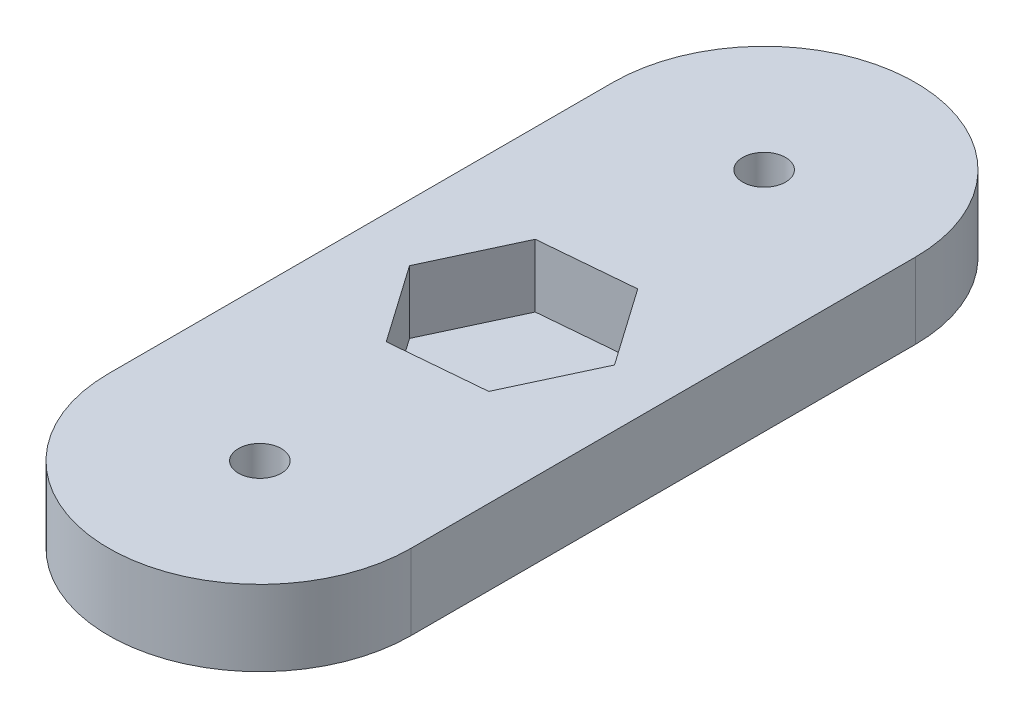
ISO-10303-21;
HEADER;
FILE_DESCRIPTION(('STEP AP214'),'2;1');
FILE_NAME('part.step','',(''),(''),'','','');
FILE_SCHEMA(('AUTOMOTIVE_DESIGN { 1 0 10303 214 1 1 1 1 }'));
ENDSEC;
DATA;
#1=APPLICATION_CONTEXT('core data for automotive mechanical design processes');
#2=APPLICATION_PROTOCOL_DEFINITION('international standard','automotive_design',2000,#1);
#3=PRODUCT_CONTEXT('',#1,'mechanical');
#4=PRODUCT('Part','Part','',(#3));
#5=PRODUCT_RELATED_PRODUCT_CATEGORY('part','',(#4));
#6=PRODUCT_DEFINITION_FORMATION('','',#4);
#7=PRODUCT_DEFINITION_CONTEXT('part definition',#1,'design');
#8=PRODUCT_DEFINITION('design','',#6,#7);
#9=PRODUCT_DEFINITION_SHAPE('','',#8);
#10=(LENGTH_UNIT() NAMED_UNIT(*) SI_UNIT(.MILLI.,.METRE.));
#11=(NAMED_UNIT(*) PLANE_ANGLE_UNIT() SI_UNIT($,.RADIAN.));
#12=(NAMED_UNIT(*) SI_UNIT($,.STERADIAN.) SOLID_ANGLE_UNIT());
#13=UNCERTAINTY_MEASURE_WITH_UNIT(LENGTH_MEASURE(1.E-05),#10,'distance_accuracy_value','');
#14=(GEOMETRIC_REPRESENTATION_CONTEXT(3) GLOBAL_UNCERTAINTY_ASSIGNED_CONTEXT((#13)) GLOBAL_UNIT_ASSIGNED_CONTEXT((#10,
#11,#12)) REPRESENTATION_CONTEXT('',''));
#15=CARTESIAN_POINT('',(0.,0.,0.));
#16=DIRECTION('',(0.,0.,1.));
#17=DIRECTION('',(1.,0.,0.));
#18=AXIS2_PLACEMENT_3D('',#15,#16,#17);
#19=CARTESIAN_POINT('',(0.,6.,0.));
#20=DIRECTION('',(0.,1.,0.));
#21=DIRECTION('',(0.,0.,1.));
#22=AXIS2_PLACEMENT_3D('',#19,#20,#21);
#23=PLANE('',#22);
#24=DIRECTION('',(0.996194698091745,0.,-0.0871557427476616));
#25=VECTOR('',#24,1.);
#26=CARTESIAN_POINT('',(-3.17198397334575,6.,-13.1976584174146));
#27=LINE('',#26,#25);
#28=CARTESIAN_POINT('',(-3.17198397334575,6.,-13.1976584174146));
#29=VERTEX_POINT('',#28);
#30=CARTESIAN_POINT('',(4.30500862906536,6.,-13.8518105073928));
#31=VERTEX_POINT('',#30);
#32=EDGE_CURVE('E48',#29,#31,#27,.T.);
#33=ORIENTED_EDGE('',*,*,#32,.F.);
#34=DIRECTION('',(0.573576436351049,0.,0.81915204428899));
#35=VECTOR('',#34,1.);
#36=CARTESIAN_POINT('',(-7.47699260241111,6.,-19.3458479100218));
#37=LINE('',#36,#35);
#38=CARTESIAN_POINT('',(-7.47699260241111,6.,-19.3458479100218));
#39=VERTEX_POINT('',#38);
#40=EDGE_CURVE('E140',#39,#29,#37,.T.);
#41=ORIENTED_EDGE('',*,*,#40,.F.);
#42=DIRECTION('',(-0.422618261740697,0.,0.906307787036651));
#43=VECTOR('',#42,1.);
#44=CARTESIAN_POINT('',(-4.30500862906535,6.,-26.1481894926072));
#45=LINE('',#44,#43);
#46=CARTESIAN_POINT('',(-4.30500862906535,6.,-26.1481894926072));
#47=VERTEX_POINT('',#46);
#48=EDGE_CURVE('E143',#47,#39,#45,.T.);
#49=ORIENTED_EDGE('',*,*,#48,.F.);
#50=DIRECTION('',(-0.996194698091745,0.,0.0871557427476619));
#51=VECTOR('',#50,1.);
#52=CARTESIAN_POINT('',(3.17198397334575,6.,-26.8023415825854));
#53=LINE('',#52,#51);
#54=CARTESIAN_POINT('',(3.17198397334575,6.,-26.8023415825854));
#55=VERTEX_POINT('',#54);
#56=EDGE_CURVE('E159',#55,#47,#53,.T.);
#57=ORIENTED_EDGE('',*,*,#56,.F.);
#58=DIRECTION('',(-0.573576436351049,0.,-0.819152044288989));
#59=VECTOR('',#58,1.);
#60=CARTESIAN_POINT('',(7.47699260241111,6.,-20.6541520899782));
#61=LINE('',#60,#59);
#62=CARTESIAN_POINT('',(7.47699260241111,6.,-20.6541520899782));
#63=VERTEX_POINT('',#62);
#64=EDGE_CURVE('E156',#63,#55,#61,.T.);
#65=ORIENTED_EDGE('',*,*,#64,.F.);
#66=DIRECTION('',(0.422618261740696,0.,-0.906307787036651));
#67=VECTOR('',#66,1.);
#68=CARTESIAN_POINT('',(4.30500862906536,6.,-13.8518105073928));
#69=LINE('',#68,#67);
#70=EDGE_CURVE('E154',#31,#63,#69,.T.);
#71=ORIENTED_EDGE('',*,*,#70,.F.);
#72=EDGE_LOOP('',(#33,#41,#49,#57,#65,#71));
#73=FACE_BOUND('',#72,.T.);
#74=CARTESIAN_POINT('',(0.,6.,-40.));
#75=DIRECTION('',(0.,1.,0.));
#76=DIRECTION('',(0.,0.,1.));
#77=AXIS2_PLACEMENT_3D('',#74,#75,#76);
#78=CIRCLE('',#77,1.7);
#79=CARTESIAN_POINT('',(0.,6.,-38.3));
#80=VERTEX_POINT('',#79);
#81=EDGE_CURVE('E180',#80,#80,#78,.T.);
#82=ORIENTED_EDGE('',*,*,#81,.F.);
#83=EDGE_LOOP('',(#82));
#84=FACE_BOUND('',#83,.T.);
#85=CARTESIAN_POINT('',(0.,6.,0.));
#86=DIRECTION('',(0.,1.,0.));
#87=DIRECTION('',(0.,0.,1.));
#88=AXIS2_PLACEMENT_3D('',#85,#86,#87);
#89=CIRCLE('',#88,12.);
#90=CARTESIAN_POINT('',(-12.,6.,0.));
#91=VERTEX_POINT('',#90);
#92=CARTESIAN_POINT('',(12.,6.,0.));
#93=VERTEX_POINT('',#92);
#94=EDGE_CURVE('E186',#91,#93,#89,.T.);
#95=ORIENTED_EDGE('',*,*,#94,.T.);
#96=DIRECTION('',(0.,0.,-1.));
#97=VECTOR('',#96,1.);
#98=CARTESIAN_POINT('',(12.,6.,0.));
#99=LINE('',#98,#97);
#100=CARTESIAN_POINT('',(12.,6.,-40.));
#101=VERTEX_POINT('',#100);
#102=EDGE_CURVE('E85',#93,#101,#99,.T.);
#103=ORIENTED_EDGE('',*,*,#102,.T.);
#104=CARTESIAN_POINT('',(0.,6.,-40.));
#105=DIRECTION('',(0.,1.,0.));
#106=DIRECTION('',(0.,0.,1.));
#107=AXIS2_PLACEMENT_3D('',#104,#105,#106);
#108=CIRCLE('',#107,12.);
#109=CARTESIAN_POINT('',(-12.,6.,-40.));
#110=VERTEX_POINT('',#109);
#111=EDGE_CURVE('E189',#101,#110,#108,.T.);
#112=ORIENTED_EDGE('',*,*,#111,.T.);
#113=DIRECTION('',(0.,0.,1.));
#114=VECTOR('',#113,1.);
#115=CARTESIAN_POINT('',(-12.,6.,0.));
#116=LINE('',#115,#114);
#117=EDGE_CURVE('E57',#110,#91,#116,.T.);
#118=ORIENTED_EDGE('',*,*,#117,.T.);
#119=EDGE_LOOP('',(#95,#103,#112,#118));
#120=FACE_BOUND('',#119,.T.);
#121=CARTESIAN_POINT('',(0.,6.,0.));
#122=DIRECTION('',(0.,1.,0.));
#123=DIRECTION('',(0.,0.,1.));
#124=AXIS2_PLACEMENT_3D('',#121,#122,#123);
#125=CIRCLE('',#124,1.7);
#126=CARTESIAN_POINT('',(0.,6.,1.7));
#127=VERTEX_POINT('',#126);
#128=EDGE_CURVE('E174',#127,#127,#125,.T.);
#129=ORIENTED_EDGE('',*,*,#128,.F.);
#130=EDGE_LOOP('',(#129));
#131=FACE_BOUND('',#130,.T.);
#132=ADVANCED_FACE('F33',(#73,#84,#120,#131),#23,.T.);
#133=CARTESIAN_POINT('',(0.,0.,0.));
#134=DIRECTION('',(0.,1.,0.));
#135=DIRECTION('',(0.,0.,1.));
#136=AXIS2_PLACEMENT_3D('',#133,#134,#135);
#137=PLANE('',#136);
#138=CARTESIAN_POINT('',(0.,0.,-40.));
#139=DIRECTION('',(0.,1.,0.));
#140=DIRECTION('',(0.,0.,1.));
#141=AXIS2_PLACEMENT_3D('',#138,#139,#140);
#142=CIRCLE('',#141,1.7);
#143=CARTESIAN_POINT('',(0.,0.,-38.3));
#144=VERTEX_POINT('',#143);
#145=EDGE_CURVE('E177',#144,#144,#142,.T.);
#146=ORIENTED_EDGE('',*,*,#145,.T.);
#147=EDGE_LOOP('',(#146));
#148=FACE_BOUND('',#147,.T.);
#149=CARTESIAN_POINT('',(0.,0.,0.));
#150=DIRECTION('',(0.,1.,0.));
#151=DIRECTION('',(0.,0.,1.));
#152=AXIS2_PLACEMENT_3D('',#149,#150,#151);
#153=CIRCLE('',#152,12.);
#154=CARTESIAN_POINT('',(-12.,0.,0.));
#155=VERTEX_POINT('',#154);
#156=CARTESIAN_POINT('',(12.,0.,0.));
#157=VERTEX_POINT('',#156);
#158=EDGE_CURVE('E183',#155,#157,#153,.T.);
#159=ORIENTED_EDGE('',*,*,#158,.F.);
#160=DIRECTION('',(0.,0.,1.));
#161=VECTOR('',#160,1.);
#162=CARTESIAN_POINT('',(-12.,0.,0.));
#163=LINE('',#162,#161);
#164=CARTESIAN_POINT('',(-12.,0.,-40.));
#165=VERTEX_POINT('',#164);
#166=EDGE_CURVE('E78',#165,#155,#163,.T.);
#167=ORIENTED_EDGE('',*,*,#166,.F.);
#168=CARTESIAN_POINT('',(0.,0.,-40.));
#169=DIRECTION('',(0.,1.,0.));
#170=DIRECTION('',(0.,0.,1.));
#171=AXIS2_PLACEMENT_3D('',#168,#169,#170);
#172=CIRCLE('',#171,12.);
#173=CARTESIAN_POINT('',(12.,0.,-40.));
#174=VERTEX_POINT('',#173);
#175=EDGE_CURVE('E197',#174,#165,#172,.T.);
#176=ORIENTED_EDGE('',*,*,#175,.F.);
#177=DIRECTION('',(0.,0.,-1.));
#178=VECTOR('',#177,1.);
#179=CARTESIAN_POINT('',(12.,0.,0.));
#180=LINE('',#179,#178);
#181=EDGE_CURVE('E195',#157,#174,#180,.T.);
#182=ORIENTED_EDGE('',*,*,#181,.F.);
#183=EDGE_LOOP('',(#159,#167,#176,#182));
#184=FACE_BOUND('',#183,.T.);
#185=CARTESIAN_POINT('',(0.,0.,0.));
#186=DIRECTION('',(0.,1.,0.));
#187=DIRECTION('',(0.,0.,1.));
#188=AXIS2_PLACEMENT_3D('',#185,#186,#187);
#189=CIRCLE('',#188,1.7);
#190=CARTESIAN_POINT('',(0.,0.,1.7));
#191=VERTEX_POINT('',#190);
#192=EDGE_CURVE('E166',#191,#191,#189,.T.);
#193=ORIENTED_EDGE('',*,*,#192,.T.);
#194=EDGE_LOOP('',(#193));
#195=FACE_BOUND('',#194,.T.);
#196=ADVANCED_FACE('F210',(#148,#184,#195),#137,.F.);
#197=CARTESIAN_POINT('',(0.,6.,0.));
#198=DIRECTION('',(0.,-1.,0.));
#199=DIRECTION('',(0.,0.,-1.));
#200=AXIS2_PLACEMENT_3D('',#197,#198,#199);
#201=CYLINDRICAL_SURFACE('',#200,12.);
#202=ORIENTED_EDGE('',*,*,#158,.T.);
#203=DIRECTION('',(0.,-1.,0.));
#204=VECTOR('',#203,1.);
#205=CARTESIAN_POINT('',(12.,6.,0.));
#206=LINE('',#205,#204);
#207=EDGE_CURVE('E11',#93,#157,#206,.T.);
#208=ORIENTED_EDGE('',*,*,#207,.F.);
#209=ORIENTED_EDGE('',*,*,#94,.F.);
#210=DIRECTION('',(0.,-1.,0.));
#211=VECTOR('',#210,1.);
#212=CARTESIAN_POINT('',(-12.,6.,0.));
#213=LINE('',#212,#211);
#214=EDGE_CURVE('E192',#91,#155,#213,.T.);
#215=ORIENTED_EDGE('',*,*,#214,.T.);
#216=EDGE_LOOP('',(#202,#208,#209,#215));
#217=FACE_BOUND('',#216,.T.);
#218=ADVANCED_FACE('F35',(#217),#201,.T.);
#219=CARTESIAN_POINT('',(12.,6.,0.));
#220=DIRECTION('',(-1.,0.,0.));
#221=DIRECTION('',(0.,0.,1.));
#222=AXIS2_PLACEMENT_3D('',#219,#220,#221);
#223=PLANE('',#222);
#224=ORIENTED_EDGE('',*,*,#181,.T.);
#225=DIRECTION('',(0.,-1.,0.));
#226=VECTOR('',#225,1.);
#227=CARTESIAN_POINT('',(12.,6.,-40.));
#228=LINE('',#227,#226);
#229=EDGE_CURVE('E41',#101,#174,#228,.T.);
#230=ORIENTED_EDGE('',*,*,#229,.F.);
#231=ORIENTED_EDGE('',*,*,#102,.F.);
#232=ORIENTED_EDGE('',*,*,#207,.T.);
#233=EDGE_LOOP('',(#224,#230,#231,#232));
#234=FACE_BOUND('',#233,.T.);
#235=ADVANCED_FACE('F226',(#234),#223,.F.);
#236=CARTESIAN_POINT('',(0.,6.,-40.));
#237=DIRECTION('',(0.,-1.,0.));
#238=DIRECTION('',(0.,0.,-1.));
#239=AXIS2_PLACEMENT_3D('',#236,#237,#238);
#240=CYLINDRICAL_SURFACE('',#239,12.);
#241=ORIENTED_EDGE('',*,*,#175,.T.);
#242=DIRECTION('',(0.,-1.,0.));
#243=VECTOR('',#242,1.);
#244=CARTESIAN_POINT('',(-12.,6.,-40.));
#245=LINE('',#244,#243);
#246=EDGE_CURVE('E201',#110,#165,#245,.T.);
#247=ORIENTED_EDGE('',*,*,#246,.F.);
#248=ORIENTED_EDGE('',*,*,#111,.F.);
#249=ORIENTED_EDGE('',*,*,#229,.T.);
#250=EDGE_LOOP('',(#241,#247,#248,#249));
#251=FACE_BOUND('',#250,.T.);
#252=ADVANCED_FACE('F206',(#251),#240,.T.);
#253=CARTESIAN_POINT('',(-12.,6.,0.));
#254=DIRECTION('',(1.,0.,0.));
#255=DIRECTION('',(0.,0.,-1.));
#256=AXIS2_PLACEMENT_3D('',#253,#254,#255);
#257=PLANE('',#256);
#258=ORIENTED_EDGE('',*,*,#166,.T.);
#259=ORIENTED_EDGE('',*,*,#214,.F.);
#260=ORIENTED_EDGE('',*,*,#117,.F.);
#261=ORIENTED_EDGE('',*,*,#246,.T.);
#262=EDGE_LOOP('',(#258,#259,#260,#261));
#263=FACE_BOUND('',#262,.T.);
#264=ADVANCED_FACE('F215',(#263),#257,.F.);
#265=CARTESIAN_POINT('',(0.,6.,-40.));
#266=DIRECTION('',(0.,-1.,0.));
#267=DIRECTION('',(0.,0.,-1.));
#268=AXIS2_PLACEMENT_3D('',#265,#266,#267);
#269=CYLINDRICAL_SURFACE('',#268,1.7);
#270=ORIENTED_EDGE('',*,*,#81,.T.);
#271=EDGE_LOOP('',(#270));
#272=FACE_BOUND('',#271,.T.);
#273=ORIENTED_EDGE('',*,*,#145,.F.);
#274=EDGE_LOOP('',(#273));
#275=FACE_BOUND('',#274,.T.);
#276=ADVANCED_FACE('F217',(#272,#275),#269,.F.);
#277=CARTESIAN_POINT('',(0.,6.,0.));
#278=DIRECTION('',(0.,-1.,0.));
#279=DIRECTION('',(0.,0.,-1.));
#280=AXIS2_PLACEMENT_3D('',#277,#278,#279);
#281=CYLINDRICAL_SURFACE('',#280,1.7);
#282=ORIENTED_EDGE('',*,*,#128,.T.);
#283=EDGE_LOOP('',(#282));
#284=FACE_BOUND('',#283,.T.);
#285=ORIENTED_EDGE('',*,*,#192,.F.);
#286=EDGE_LOOP('',(#285));
#287=FACE_BOUND('',#286,.T.);
#288=ADVANCED_FACE('F223',(#284,#287),#281,.F.);
#289=CARTESIAN_POINT('',(-3.17198397334575,1.,-13.1976584174146));
#290=DIRECTION('',(0.0871557427476616,0.,0.996194698091745));
#291=DIRECTION('',(0.996194698091745,0.,-0.0871557427476616));
#292=AXIS2_PLACEMENT_3D('',#289,#290,#291);
#293=PLANE('',#292);
#294=ORIENTED_EDGE('',*,*,#32,.T.);
#295=DIRECTION('',(0.,1.,0.));
#296=VECTOR('',#295,1.);
#297=CARTESIAN_POINT('',(4.30500862906536,1.,-13.8518105073928));
#298=LINE('',#297,#296);
#299=CARTESIAN_POINT('',(4.30500862906536,1.,-13.8518105073928));
#300=VERTEX_POINT('',#299);
#301=EDGE_CURVE('E117',#300,#31,#298,.T.);
#302=ORIENTED_EDGE('',*,*,#301,.F.);
#303=DIRECTION('',(0.996194698091745,0.,-0.0871557427476616));
#304=VECTOR('',#303,1.);
#305=CARTESIAN_POINT('',(-3.17198397334575,1.,-13.1976584174146));
#306=LINE('',#305,#304);
#307=CARTESIAN_POINT('',(-3.17198397334575,1.,-13.1976584174146));
#308=VERTEX_POINT('',#307);
#309=EDGE_CURVE('E121',#308,#300,#306,.T.);
#310=ORIENTED_EDGE('',*,*,#309,.F.);
#311=DIRECTION('',(0.,1.,0.));
#312=VECTOR('',#311,1.);
#313=CARTESIAN_POINT('',(-3.17198397334575,1.,-13.1976584174146));
#314=LINE('',#313,#312);
#315=EDGE_CURVE('E164',#308,#29,#314,.T.);
#316=ORIENTED_EDGE('',*,*,#315,.T.);
#317=EDGE_LOOP('',(#294,#302,#310,#316));
#318=FACE_BOUND('',#317,.T.);
#319=ADVANCED_FACE('F119',(#318),#293,.F.);
#320=CARTESIAN_POINT('',(-7.47699260241111,1.,-19.3458479100218));
#321=DIRECTION('',(-0.81915204428899,0.,0.573576436351049));
#322=DIRECTION('',(0.573576436351049,0.,0.81915204428899));
#323=AXIS2_PLACEMENT_3D('',#320,#321,#322);
#324=PLANE('',#323);
#325=ORIENTED_EDGE('',*,*,#40,.T.);
#326=ORIENTED_EDGE('',*,*,#315,.F.);
#327=DIRECTION('',(0.573576436351049,0.,0.81915204428899));
#328=VECTOR('',#327,1.);
#329=CARTESIAN_POINT('',(-7.47699260241111,1.,-19.3458479100218));
#330=LINE('',#329,#328);
#331=CARTESIAN_POINT('',(-7.47699260241111,1.,-19.3458479100218));
#332=VERTEX_POINT('',#331);
#333=EDGE_CURVE('E127',#332,#308,#330,.T.);
#334=ORIENTED_EDGE('',*,*,#333,.F.);
#335=DIRECTION('',(0.,1.,0.));
#336=VECTOR('',#335,1.);
#337=CARTESIAN_POINT('',(-7.47699260241111,1.,-19.3458479100218));
#338=LINE('',#337,#336);
#339=EDGE_CURVE('E167',#332,#39,#338,.T.);
#340=ORIENTED_EDGE('',*,*,#339,.T.);
#341=EDGE_LOOP('',(#325,#326,#334,#340));
#342=FACE_BOUND('',#341,.T.);
#343=ADVANCED_FACE('F243',(#342),#324,.F.);
#344=CARTESIAN_POINT('',(-4.30500862906535,1.,-26.1481894926072));
#345=DIRECTION('',(-0.906307787036651,0.,-0.422618261740697));
#346=DIRECTION('',(-0.422618261740697,0.,0.906307787036651));
#347=AXIS2_PLACEMENT_3D('',#344,#345,#346);
#348=PLANE('',#347);
#349=ORIENTED_EDGE('',*,*,#48,.T.);
#350=ORIENTED_EDGE('',*,*,#339,.F.);
#351=DIRECTION('',(-0.422618261740697,0.,0.906307787036651));
#352=VECTOR('',#351,1.);
#353=CARTESIAN_POINT('',(-4.30500862906535,1.,-26.1481894926072));
#354=LINE('',#353,#352);
#355=CARTESIAN_POINT('',(-4.30500862906535,1.,-26.1481894926072));
#356=VERTEX_POINT('',#355);
#357=EDGE_CURVE('E150',#356,#332,#354,.T.);
#358=ORIENTED_EDGE('',*,*,#357,.F.);
#359=DIRECTION('',(0.,1.,0.));
#360=VECTOR('',#359,1.);
#361=CARTESIAN_POINT('',(-4.30500862906535,1.,-26.1481894926072));
#362=LINE('',#361,#360);
#363=EDGE_CURVE('E169',#356,#47,#362,.T.);
#364=ORIENTED_EDGE('',*,*,#363,.T.);
#365=EDGE_LOOP('',(#349,#350,#358,#364));
#366=FACE_BOUND('',#365,.T.);
#367=ADVANCED_FACE('F253',(#366),#348,.F.);
#368=CARTESIAN_POINT('',(3.17198397334575,1.,-26.8023415825854));
#369=DIRECTION('',(-0.087155742747662,0.,-0.996194698091745));
#370=DIRECTION('',(-0.996194698091745,0.,0.087155742747662));
#371=AXIS2_PLACEMENT_3D('',#368,#369,#370);
#372=PLANE('',#371);
#373=ORIENTED_EDGE('',*,*,#56,.T.);
#374=ORIENTED_EDGE('',*,*,#363,.F.);
#375=DIRECTION('',(-0.996194698091745,0.,0.0871557427476619));
#376=VECTOR('',#375,1.);
#377=CARTESIAN_POINT('',(3.17198397334575,1.,-26.8023415825854));
#378=LINE('',#377,#376);
#379=CARTESIAN_POINT('',(3.17198397334575,1.,-26.8023415825854));
#380=VERTEX_POINT('',#379);
#381=EDGE_CURVE('E147',#380,#356,#378,.T.);
#382=ORIENTED_EDGE('',*,*,#381,.F.);
#383=DIRECTION('',(0.,1.,0.));
#384=VECTOR('',#383,1.);
#385=CARTESIAN_POINT('',(3.17198397334575,1.,-26.8023415825854));
#386=LINE('',#385,#384);
#387=EDGE_CURVE('E171',#380,#55,#386,.T.);
#388=ORIENTED_EDGE('',*,*,#387,.T.);
#389=EDGE_LOOP('',(#373,#374,#382,#388));
#390=FACE_BOUND('',#389,.T.);
#391=ADVANCED_FACE('F249',(#390),#372,.F.);
#392=CARTESIAN_POINT('',(7.47699260241111,1.,-20.6541520899782));
#393=DIRECTION('',(0.81915204428899,0.,-0.573576436351049));
#394=DIRECTION('',(-0.573576436351049,0.,-0.81915204428899));
#395=AXIS2_PLACEMENT_3D('',#392,#393,#394);
#396=PLANE('',#395);
#397=ORIENTED_EDGE('',*,*,#64,.T.);
#398=ORIENTED_EDGE('',*,*,#387,.F.);
#399=DIRECTION('',(-0.573576436351049,0.,-0.819152044288989));
#400=VECTOR('',#399,1.);
#401=CARTESIAN_POINT('',(7.47699260241111,1.,-20.6541520899782));
#402=LINE('',#401,#400);
#403=CARTESIAN_POINT('',(7.47699260241111,1.,-20.6541520899782));
#404=VERTEX_POINT('',#403);
#405=EDGE_CURVE('E135',#404,#380,#402,.T.);
#406=ORIENTED_EDGE('',*,*,#405,.F.);
#407=DIRECTION('',(0.,1.,0.));
#408=VECTOR('',#407,1.);
#409=CARTESIAN_POINT('',(7.47699260241111,1.,-20.6541520899782));
#410=LINE('',#409,#408);
#411=EDGE_CURVE('E126',#404,#63,#410,.T.);
#412=ORIENTED_EDGE('',*,*,#411,.T.);
#413=EDGE_LOOP('',(#397,#398,#406,#412));
#414=FACE_BOUND('',#413,.T.);
#415=ADVANCED_FACE('F246',(#414),#396,.F.);
#416=CARTESIAN_POINT('',(4.30500862906536,1.,-13.8518105073928));
#417=DIRECTION('',(0.906307787036651,0.,0.422618261740696));
#418=DIRECTION('',(0.422618261740696,0.,-0.906307787036651));
#419=AXIS2_PLACEMENT_3D('',#416,#417,#418);
#420=PLANE('',#419);
#421=ORIENTED_EDGE('',*,*,#70,.T.);
#422=ORIENTED_EDGE('',*,*,#411,.F.);
#423=DIRECTION('',(0.422618261740696,0.,-0.906307787036651));
#424=VECTOR('',#423,1.);
#425=CARTESIAN_POINT('',(4.30500862906536,1.,-13.8518105073928));
#426=LINE('',#425,#424);
#427=EDGE_CURVE('E130',#300,#404,#426,.T.);
#428=ORIENTED_EDGE('',*,*,#427,.F.);
#429=ORIENTED_EDGE('',*,*,#301,.T.);
#430=EDGE_LOOP('',(#421,#422,#428,#429));
#431=FACE_BOUND('',#430,.T.);
#432=ADVANCED_FACE('F131',(#431),#420,.F.);
#433=CARTESIAN_POINT('',(0.,1.,0.));
#434=DIRECTION('',(0.,1.,0.));
#435=DIRECTION('',(0.,0.,1.));
#436=AXIS2_PLACEMENT_3D('',#433,#434,#435);
#437=PLANE('',#436);
#438=ORIENTED_EDGE('',*,*,#309,.T.);
#439=ORIENTED_EDGE('',*,*,#427,.T.);
#440=ORIENTED_EDGE('',*,*,#405,.T.);
#441=ORIENTED_EDGE('',*,*,#381,.T.);
#442=ORIENTED_EDGE('',*,*,#357,.T.);
#443=ORIENTED_EDGE('',*,*,#333,.T.);
#444=EDGE_LOOP('',(#438,#439,#440,#441,#442,#443));
#445=FACE_BOUND('',#444,.T.);
#446=ADVANCED_FACE('F137',(#445),#437,.T.);
#447=CLOSED_SHELL('',(#132,#196,#218,#235,#252,#264,#276,#288,#319,#343,#367,#391,#415,#432,#446));
#448=MANIFOLD_SOLID_BREP('B2',#447);
#449=ADVANCED_BREP_SHAPE_REPRESENTATION('',(#18,#448),#14);
#450=SHAPE_DEFINITION_REPRESENTATION(#9,#449);
ENDSEC;
END-ISO-10303-21;
